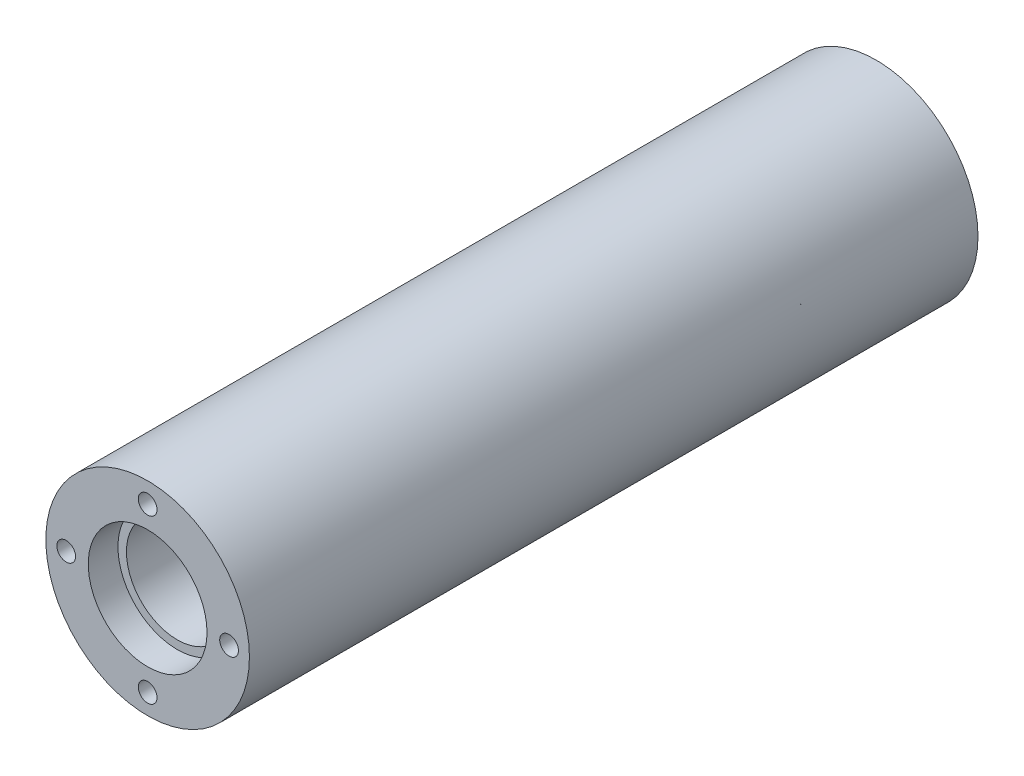
ISO-10303-21;
HEADER;
FILE_DESCRIPTION(('STEP AP214'),'2;1');
FILE_NAME('part.step','',(''),(''),'','','');
FILE_SCHEMA(('AUTOMOTIVE_DESIGN { 1 0 10303 214 1 1 1 1 }'));
ENDSEC;
DATA;
#1=APPLICATION_CONTEXT('core data for automotive mechanical design processes');
#2=APPLICATION_PROTOCOL_DEFINITION('international standard','automotive_design',2000,#1);
#3=PRODUCT_CONTEXT('',#1,'mechanical');
#4=PRODUCT('Part','Part','',(#3));
#5=PRODUCT_RELATED_PRODUCT_CATEGORY('part','',(#4));
#6=PRODUCT_DEFINITION_FORMATION('','',#4);
#7=PRODUCT_DEFINITION_CONTEXT('part definition',#1,'design');
#8=PRODUCT_DEFINITION('design','',#6,#7);
#9=PRODUCT_DEFINITION_SHAPE('','',#8);
#10=(LENGTH_UNIT() NAMED_UNIT(*) SI_UNIT(.MILLI.,.METRE.));
#11=(NAMED_UNIT(*) PLANE_ANGLE_UNIT() SI_UNIT($,.RADIAN.));
#12=(NAMED_UNIT(*) SI_UNIT($,.STERADIAN.) SOLID_ANGLE_UNIT());
#13=UNCERTAINTY_MEASURE_WITH_UNIT(LENGTH_MEASURE(1.E-05),#10,'distance_accuracy_value','');
#14=(GEOMETRIC_REPRESENTATION_CONTEXT(3) GLOBAL_UNCERTAINTY_ASSIGNED_CONTEXT((#13)) GLOBAL_UNIT_ASSIGNED_CONTEXT((#10,
#11,#12)) REPRESENTATION_CONTEXT('',''));
#15=CARTESIAN_POINT('',(0.,0.,0.));
#16=DIRECTION('',(0.,0.,1.));
#17=DIRECTION('',(1.,0.,0.));
#18=AXIS2_PLACEMENT_3D('',#15,#16,#17);
#19=CARTESIAN_POINT('',(0.,0.,136.3472));
#20=DIRECTION('',(0.,0.,-1.));
#21=DIRECTION('',(-1.,0.,0.));
#22=AXIS2_PLACEMENT_3D('',#19,#20,#21);
#23=CYLINDRICAL_SURFACE('',#22,9.525);
#24=CARTESIAN_POINT('',(0.,0.,130.79095));
#25=DIRECTION('',(0.,0.,1.));
#26=DIRECTION('',(1.,0.,0.));
#27=AXIS2_PLACEMENT_3D('',#24,#25,#26);
#28=CIRCLE('',#27,9.525);
#29=CARTESIAN_POINT('',(9.525,0.,130.79095));
#30=VERTEX_POINT('',#29);
#31=EDGE_CURVE('E55',#30,#30,#28,.T.);
#32=ORIENTED_EDGE('',*,*,#31,.T.);
#33=EDGE_LOOP('',(#32));
#34=FACE_BOUND('',#33,.T.);
#35=CARTESIAN_POINT('',(0.,0.,5.55625000000001));
#36=DIRECTION('',(0.,0.,-1.));
#37=DIRECTION('',(-1.,0.,0.));
#38=AXIS2_PLACEMENT_3D('',#35,#36,#37);
#39=CIRCLE('',#38,9.525);
#40=CARTESIAN_POINT('',(-9.525,0.,5.55625000000001));
#41=VERTEX_POINT('',#40);
#42=EDGE_CURVE('E41',#41,#41,#39,.T.);
#43=ORIENTED_EDGE('',*,*,#42,.T.);
#44=EDGE_LOOP('',(#43));
#45=FACE_BOUND('',#44,.T.);
#46=ADVANCED_FACE('F37',(#34,#45),#23,.F.);
#47=CARTESIAN_POINT('',(0.,0.,136.3472));
#48=DIRECTION('',(0.,0.,1.));
#49=DIRECTION('',(1.,0.,0.));
#50=AXIS2_PLACEMENT_3D('',#47,#48,#49);
#51=PLANE('',#50);
#52=CARTESIAN_POINT('',(0.,0.,136.3472));
#53=DIRECTION('',(0.,0.,1.));
#54=DIRECTION('',(1.,0.,0.));
#55=AXIS2_PLACEMENT_3D('',#52,#53,#54);
#56=CIRCLE('',#55,11.1125);
#57=CARTESIAN_POINT('',(11.1125,0.,136.3472));
#58=VERTEX_POINT('',#57);
#59=EDGE_CURVE('E65',#58,#58,#56,.T.);
#60=ORIENTED_EDGE('',*,*,#59,.F.);
#61=EDGE_LOOP('',(#60));
#62=FACE_BOUND('',#61,.T.);
#63=CARTESIAN_POINT('',(0.,15.24,136.3472));
#64=DIRECTION('',(0.,0.,1.));
#65=DIRECTION('',(1.,0.,0.));
#66=AXIS2_PLACEMENT_3D('',#63,#64,#65);
#67=CIRCLE('',#66,1.7526);
#68=CARTESIAN_POINT('',(1.7526,15.24,136.3472));
#69=VERTEX_POINT('',#68);
#70=EDGE_CURVE('E78',#69,#69,#67,.T.);
#71=ORIENTED_EDGE('',*,*,#70,.F.);
#72=EDGE_LOOP('',(#71));
#73=FACE_BOUND('',#72,.T.);
#74=CARTESIAN_POINT('',(15.2400000000005,5.01916330515765E-13,136.3472));
#75=DIRECTION('',(0.,0.,1.));
#76=DIRECTION('',(1.,0.,0.));
#77=AXIS2_PLACEMENT_3D('',#74,#75,#76);
#78=CIRCLE('',#77,1.7526);
#79=CARTESIAN_POINT('',(16.9926000000005,5.01916330515765E-13,136.3472));
#80=VERTEX_POINT('',#79);
#81=EDGE_CURVE('E81',#80,#80,#78,.T.);
#82=ORIENTED_EDGE('',*,*,#81,.F.);
#83=EDGE_LOOP('',(#82));
#84=FACE_BOUND('',#83,.T.);
#85=CARTESIAN_POINT('',(1.00383266103153E-12,-15.24,136.3472));
#86=DIRECTION('',(0.,0.,1.));
#87=DIRECTION('',(1.,0.,0.));
#88=AXIS2_PLACEMENT_3D('',#85,#86,#87);
#89=CIRCLE('',#88,1.7526);
#90=CARTESIAN_POINT('',(1.752600000001,-15.24,136.3472));
#91=VERTEX_POINT('',#90);
#92=EDGE_CURVE('E87',#91,#91,#89,.T.);
#93=ORIENTED_EDGE('',*,*,#92,.F.);
#94=EDGE_LOOP('',(#93));
#95=FACE_BOUND('',#94,.T.);
#96=CARTESIAN_POINT('',(-15.2399999999995,-5.03782692237666E-13,136.3472));
#97=DIRECTION('',(0.,0.,1.));
#98=DIRECTION('',(1.,0.,0.));
#99=AXIS2_PLACEMENT_3D('',#96,#97,#98);
#100=CIRCLE('',#99,1.7526);
#101=CARTESIAN_POINT('',(-13.4873999999995,-5.03782692237666E-13,136.3472));
#102=VERTEX_POINT('',#101);
#103=EDGE_CURVE('E62',#102,#102,#100,.T.);
#104=ORIENTED_EDGE('',*,*,#103,.F.);
#105=EDGE_LOOP('',(#104));
#106=FACE_BOUND('',#105,.T.);
#107=CARTESIAN_POINT('',(0.,0.,136.3472));
#108=DIRECTION('',(0.,0.,1.));
#109=DIRECTION('',(1.,0.,0.));
#110=AXIS2_PLACEMENT_3D('',#107,#108,#109);
#111=CIRCLE('',#110,19.05);
#112=CARTESIAN_POINT('',(19.05,0.,136.3472));
#113=VERTEX_POINT('',#112);
#114=EDGE_CURVE('E10',#113,#113,#111,.T.);
#115=ORIENTED_EDGE('',*,*,#114,.T.);
#116=EDGE_LOOP('',(#115));
#117=FACE_BOUND('',#116,.T.);
#118=ADVANCED_FACE('F133',(#62,#73,#84,#95,#106,#117),#51,.T.);
#119=CARTESIAN_POINT('',(0.,0.,0.));
#120=DIRECTION('',(0.,0.,1.));
#121=DIRECTION('',(1.,0.,0.));
#122=AXIS2_PLACEMENT_3D('',#119,#120,#121);
#123=PLANE('',#122);
#124=CARTESIAN_POINT('',(0.,0.,0.));
#125=DIRECTION('',(0.,0.,-1.));
#126=DIRECTION('',(-1.,0.,0.));
#127=AXIS2_PLACEMENT_3D('',#124,#125,#126);
#128=CIRCLE('',#127,11.1125);
#129=CARTESIAN_POINT('',(-11.1125,0.,0.));
#130=VERTEX_POINT('',#129);
#131=EDGE_CURVE('E72',#130,#130,#128,.T.);
#132=ORIENTED_EDGE('',*,*,#131,.F.);
#133=EDGE_LOOP('',(#132));
#134=FACE_BOUND('',#133,.T.);
#135=CARTESIAN_POINT('',(0.,15.24,0.));
#136=DIRECTION('',(0.,0.,-1.));
#137=DIRECTION('',(-1.,0.,0.));
#138=AXIS2_PLACEMENT_3D('',#135,#136,#137);
#139=CIRCLE('',#138,1.7526);
#140=CARTESIAN_POINT('',(-1.7526,15.24,0.));
#141=VERTEX_POINT('',#140);
#142=EDGE_CURVE('E97',#141,#141,#139,.T.);
#143=ORIENTED_EDGE('',*,*,#142,.F.);
#144=EDGE_LOOP('',(#143));
#145=FACE_BOUND('',#144,.T.);
#146=CARTESIAN_POINT('',(-15.2400000000005,5.01916330515765E-13,0.));
#147=DIRECTION('',(0.,0.,-1.));
#148=DIRECTION('',(-1.,0.,0.));
#149=AXIS2_PLACEMENT_3D('',#146,#147,#148);
#150=CIRCLE('',#149,1.7526);
#151=CARTESIAN_POINT('',(-16.9926000000005,5.01916330515765E-13,0.));
#152=VERTEX_POINT('',#151);
#153=EDGE_CURVE('E100',#152,#152,#150,.T.);
#154=ORIENTED_EDGE('',*,*,#153,.F.);
#155=EDGE_LOOP('',(#154));
#156=FACE_BOUND('',#155,.T.);
#157=CARTESIAN_POINT('',(-1.00383266103153E-12,-15.24,0.));
#158=DIRECTION('',(0.,0.,-1.));
#159=DIRECTION('',(-1.,0.,0.));
#160=AXIS2_PLACEMENT_3D('',#157,#158,#159);
#161=CIRCLE('',#160,1.7526);
#162=CARTESIAN_POINT('',(-1.752600000001,-15.24,0.));
#163=VERTEX_POINT('',#162);
#164=EDGE_CURVE('E106',#163,#163,#161,.T.);
#165=ORIENTED_EDGE('',*,*,#164,.F.);
#166=EDGE_LOOP('',(#165));
#167=FACE_BOUND('',#166,.T.);
#168=CARTESIAN_POINT('',(15.2399999999995,-5.03782692237666E-13,0.));
#169=DIRECTION('',(0.,0.,-1.));
#170=DIRECTION('',(-1.,0.,0.));
#171=AXIS2_PLACEMENT_3D('',#168,#169,#170);
#172=CIRCLE('',#171,1.7526);
#173=CARTESIAN_POINT('',(13.4873999999995,-5.03782692237666E-13,0.));
#174=VERTEX_POINT('',#173);
#175=EDGE_CURVE('E111',#174,#174,#172,.T.);
#176=ORIENTED_EDGE('',*,*,#175,.F.);
#177=EDGE_LOOP('',(#176));
#178=FACE_BOUND('',#177,.T.);
#179=CARTESIAN_POINT('',(0.,0.,0.));
#180=DIRECTION('',(0.,0.,1.));
#181=DIRECTION('',(1.,0.,0.));
#182=AXIS2_PLACEMENT_3D('',#179,#180,#181);
#183=CIRCLE('',#182,19.05);
#184=CARTESIAN_POINT('',(19.05,0.,0.));
#185=VERTEX_POINT('',#184);
#186=EDGE_CURVE('E45',#185,#185,#183,.T.);
#187=ORIENTED_EDGE('',*,*,#186,.F.);
#188=EDGE_LOOP('',(#187));
#189=FACE_BOUND('',#188,.T.);
#190=ADVANCED_FACE('F129',(#134,#145,#156,#167,#178,#189),#123,.F.);
#191=CARTESIAN_POINT('',(0.,0.,136.3472));
#192=DIRECTION('',(0.,0.,-1.));
#193=DIRECTION('',(-1.,0.,0.));
#194=AXIS2_PLACEMENT_3D('',#191,#192,#193);
#195=CYLINDRICAL_SURFACE('',#194,19.05);
#196=ORIENTED_EDGE('',*,*,#114,.F.);
#197=EDGE_LOOP('',(#196));
#198=FACE_BOUND('',#197,.T.);
#199=ORIENTED_EDGE('',*,*,#186,.T.);
#200=EDGE_LOOP('',(#199));
#201=FACE_BOUND('',#200,.T.);
#202=ADVANCED_FACE('F39',(#198,#201),#195,.T.);
#203=CARTESIAN_POINT('',(15.2399999999995,-5.03782692237666E-13,9.525));
#204=DIRECTION('',(0.,0.,-1.));
#205=DIRECTION('',(-1.,0.,0.));
#206=AXIS2_PLACEMENT_3D('',#203,#204,#205);
#207=CYLINDRICAL_SURFACE('',#206,1.7526);
#208=CARTESIAN_POINT('',(15.2399999999995,-5.03782692237666E-13,9.525));
#209=DIRECTION('',(0.,0.,-1.));
#210=DIRECTION('',(-1.,0.,0.));
#211=AXIS2_PLACEMENT_3D('',#208,#209,#210);
#212=CIRCLE('',#211,1.7526);
#213=CARTESIAN_POINT('',(13.4873999999995,-5.03782692237666E-13,9.525));
#214=VERTEX_POINT('',#213);
#215=EDGE_CURVE('E53',#214,#214,#212,.T.);
#216=ORIENTED_EDGE('',*,*,#215,.F.);
#217=EDGE_LOOP('',(#216));
#218=FACE_BOUND('',#217,.T.);
#219=ORIENTED_EDGE('',*,*,#175,.T.);
#220=EDGE_LOOP('',(#219));
#221=FACE_BOUND('',#220,.T.);
#222=ADVANCED_FACE('F120',(#218,#221),#207,.F.);
#223=CARTESIAN_POINT('',(15.2399999999995,-5.03782692237666E-13,9.525));
#224=DIRECTION('',(0.,0.,-1.));
#225=DIRECTION('',(-1.,0.,0.));
#226=AXIS2_PLACEMENT_3D('',#223,#224,#225);
#227=PLANE('',#226);
#228=ORIENTED_EDGE('',*,*,#215,.T.);
#229=EDGE_LOOP('',(#228));
#230=FACE_BOUND('',#229,.T.);
#231=ADVANCED_FACE('F118',(#230),#227,.T.);
#232=CARTESIAN_POINT('',(-1.00383266103153E-12,-15.24,9.525));
#233=DIRECTION('',(0.,0.,-1.));
#234=DIRECTION('',(-1.,0.,0.));
#235=AXIS2_PLACEMENT_3D('',#232,#233,#234);
#236=CYLINDRICAL_SURFACE('',#235,1.7526);
#237=CARTESIAN_POINT('',(-1.00383266103153E-12,-15.24,9.525));
#238=DIRECTION('',(0.,0.,-1.));
#239=DIRECTION('',(-1.,0.,0.));
#240=AXIS2_PLACEMENT_3D('',#237,#238,#239);
#241=CIRCLE('',#240,1.7526);
#242=CARTESIAN_POINT('',(-1.752600000001,-15.24,9.525));
#243=VERTEX_POINT('',#242);
#244=EDGE_CURVE('E109',#243,#243,#241,.T.);
#245=ORIENTED_EDGE('',*,*,#244,.F.);
#246=EDGE_LOOP('',(#245));
#247=FACE_BOUND('',#246,.T.);
#248=ORIENTED_EDGE('',*,*,#164,.T.);
#249=EDGE_LOOP('',(#248));
#250=FACE_BOUND('',#249,.T.);
#251=ADVANCED_FACE('F127',(#247,#250),#236,.F.);
#252=CARTESIAN_POINT('',(-1.00383266103153E-12,-15.24,9.525));
#253=DIRECTION('',(0.,0.,-1.));
#254=DIRECTION('',(-1.,0.,0.));
#255=AXIS2_PLACEMENT_3D('',#252,#253,#254);
#256=PLANE('',#255);
#257=ORIENTED_EDGE('',*,*,#244,.T.);
#258=EDGE_LOOP('',(#257));
#259=FACE_BOUND('',#258,.T.);
#260=ADVANCED_FACE('F159',(#259),#256,.T.);
#261=CARTESIAN_POINT('',(-15.2400000000005,5.01916330515765E-13,9.525));
#262=DIRECTION('',(0.,0.,-1.));
#263=DIRECTION('',(-1.,0.,0.));
#264=AXIS2_PLACEMENT_3D('',#261,#262,#263);
#265=CYLINDRICAL_SURFACE('',#264,1.7526);
#266=CARTESIAN_POINT('',(-15.2400000000005,5.01916330515765E-13,9.525));
#267=DIRECTION('',(0.,0.,-1.));
#268=DIRECTION('',(-1.,0.,0.));
#269=AXIS2_PLACEMENT_3D('',#266,#267,#268);
#270=CIRCLE('',#269,1.7526);
#271=CARTESIAN_POINT('',(-16.9926000000005,5.01916330515765E-13,9.525));
#272=VERTEX_POINT('',#271);
#273=EDGE_CURVE('E103',#272,#272,#270,.T.);
#274=ORIENTED_EDGE('',*,*,#273,.F.);
#275=EDGE_LOOP('',(#274));
#276=FACE_BOUND('',#275,.T.);
#277=ORIENTED_EDGE('',*,*,#153,.T.);
#278=EDGE_LOOP('',(#277));
#279=FACE_BOUND('',#278,.T.);
#280=ADVANCED_FACE('F165',(#276,#279),#265,.F.);
#281=CARTESIAN_POINT('',(-15.2400000000005,5.01916330515765E-13,9.525));
#282=DIRECTION('',(0.,0.,-1.));
#283=DIRECTION('',(-1.,0.,0.));
#284=AXIS2_PLACEMENT_3D('',#281,#282,#283);
#285=PLANE('',#284);
#286=ORIENTED_EDGE('',*,*,#273,.T.);
#287=EDGE_LOOP('',(#286));
#288=FACE_BOUND('',#287,.T.);
#289=ADVANCED_FACE('F169',(#288),#285,.T.);
#290=CARTESIAN_POINT('',(0.,15.24,9.525));
#291=DIRECTION('',(0.,0.,-1.));
#292=DIRECTION('',(-1.,0.,0.));
#293=AXIS2_PLACEMENT_3D('',#290,#291,#292);
#294=CYLINDRICAL_SURFACE('',#293,1.7526);
#295=CARTESIAN_POINT('',(0.,15.24,9.525));
#296=DIRECTION('',(0.,0.,-1.));
#297=DIRECTION('',(-1.,0.,0.));
#298=AXIS2_PLACEMENT_3D('',#295,#296,#297);
#299=CIRCLE('',#298,1.7526);
#300=CARTESIAN_POINT('',(-1.7526,15.24,9.525));
#301=VERTEX_POINT('',#300);
#302=EDGE_CURVE('E50',#301,#301,#299,.T.);
#303=ORIENTED_EDGE('',*,*,#302,.F.);
#304=EDGE_LOOP('',(#303));
#305=FACE_BOUND('',#304,.T.);
#306=ORIENTED_EDGE('',*,*,#142,.T.);
#307=EDGE_LOOP('',(#306));
#308=FACE_BOUND('',#307,.T.);
#309=ADVANCED_FACE('F172',(#305,#308),#294,.F.);
#310=CARTESIAN_POINT('',(0.,15.24,9.525));
#311=DIRECTION('',(0.,0.,-1.));
#312=DIRECTION('',(-1.,0.,0.));
#313=AXIS2_PLACEMENT_3D('',#310,#311,#312);
#314=PLANE('',#313);
#315=ORIENTED_EDGE('',*,*,#302,.T.);
#316=EDGE_LOOP('',(#315));
#317=FACE_BOUND('',#316,.T.);
#318=ADVANCED_FACE('F179',(#317),#314,.T.);
#319=CARTESIAN_POINT('',(-15.2399999999995,-5.03782692237666E-13,126.8222));
#320=DIRECTION('',(0.,0.,1.));
#321=DIRECTION('',(1.,0.,0.));
#322=AXIS2_PLACEMENT_3D('',#319,#320,#321);
#323=CYLINDRICAL_SURFACE('',#322,1.7526);
#324=CARTESIAN_POINT('',(-15.2399999999995,-5.03782692237666E-13,126.8222));
#325=DIRECTION('',(0.,0.,1.));
#326=DIRECTION('',(1.,0.,0.));
#327=AXIS2_PLACEMENT_3D('',#324,#325,#326);
#328=CIRCLE('',#327,1.7526);
#329=CARTESIAN_POINT('',(-13.4873999999995,-5.03782692237666E-13,126.8222));
#330=VERTEX_POINT('',#329);
#331=EDGE_CURVE('E57',#330,#330,#328,.T.);
#332=ORIENTED_EDGE('',*,*,#331,.F.);
#333=EDGE_LOOP('',(#332));
#334=FACE_BOUND('',#333,.T.);
#335=ORIENTED_EDGE('',*,*,#103,.T.);
#336=EDGE_LOOP('',(#335));
#337=FACE_BOUND('',#336,.T.);
#338=ADVANCED_FACE('F183',(#334,#337),#323,.F.);
#339=CARTESIAN_POINT('',(-15.2399999999995,-5.03782692237666E-13,126.8222));
#340=DIRECTION('',(0.,0.,1.));
#341=DIRECTION('',(1.,0.,0.));
#342=AXIS2_PLACEMENT_3D('',#339,#340,#341);
#343=PLANE('',#342);
#344=ORIENTED_EDGE('',*,*,#331,.T.);
#345=EDGE_LOOP('',(#344));
#346=FACE_BOUND('',#345,.T.);
#347=ADVANCED_FACE('F185',(#346),#343,.T.);
#348=CARTESIAN_POINT('',(1.00383266103153E-12,-15.24,126.8222));
#349=DIRECTION('',(0.,0.,1.));
#350=DIRECTION('',(1.,0.,0.));
#351=AXIS2_PLACEMENT_3D('',#348,#349,#350);
#352=CYLINDRICAL_SURFACE('',#351,1.7526);
#353=CARTESIAN_POINT('',(1.00383266103153E-12,-15.24,126.8222));
#354=DIRECTION('',(0.,0.,1.));
#355=DIRECTION('',(1.,0.,0.));
#356=AXIS2_PLACEMENT_3D('',#353,#354,#355);
#357=CIRCLE('',#356,1.7526);
#358=CARTESIAN_POINT('',(1.752600000001,-15.24,126.8222));
#359=VERTEX_POINT('',#358);
#360=EDGE_CURVE('E90',#359,#359,#357,.T.);
#361=ORIENTED_EDGE('',*,*,#360,.F.);
#362=EDGE_LOOP('',(#361));
#363=FACE_BOUND('',#362,.T.);
#364=ORIENTED_EDGE('',*,*,#92,.T.);
#365=EDGE_LOOP('',(#364));
#366=FACE_BOUND('',#365,.T.);
#367=ADVANCED_FACE('F188',(#363,#366),#352,.F.);
#368=CARTESIAN_POINT('',(1.00383266103153E-12,-15.24,126.8222));
#369=DIRECTION('',(0.,0.,1.));
#370=DIRECTION('',(1.,0.,0.));
#371=AXIS2_PLACEMENT_3D('',#368,#369,#370);
#372=PLANE('',#371);
#373=ORIENTED_EDGE('',*,*,#360,.T.);
#374=EDGE_LOOP('',(#373));
#375=FACE_BOUND('',#374,.T.);
#376=ADVANCED_FACE('F193',(#375),#372,.T.);
#377=CARTESIAN_POINT('',(15.2400000000005,5.01916330515765E-13,126.8222));
#378=DIRECTION('',(0.,0.,1.));
#379=DIRECTION('',(1.,0.,0.));
#380=AXIS2_PLACEMENT_3D('',#377,#378,#379);
#381=CYLINDRICAL_SURFACE('',#380,1.7526);
#382=CARTESIAN_POINT('',(15.2400000000005,5.01916330515765E-13,126.8222));
#383=DIRECTION('',(0.,0.,1.));
#384=DIRECTION('',(1.,0.,0.));
#385=AXIS2_PLACEMENT_3D('',#382,#383,#384);
#386=CIRCLE('',#385,1.7526);
#387=CARTESIAN_POINT('',(16.9926000000005,5.01916330515765E-13,126.8222));
#388=VERTEX_POINT('',#387);
#389=EDGE_CURVE('E84',#388,#388,#386,.T.);
#390=ORIENTED_EDGE('',*,*,#389,.F.);
#391=EDGE_LOOP('',(#390));
#392=FACE_BOUND('',#391,.T.);
#393=ORIENTED_EDGE('',*,*,#81,.T.);
#394=EDGE_LOOP('',(#393));
#395=FACE_BOUND('',#394,.T.);
#396=ADVANCED_FACE('F196',(#392,#395),#381,.F.);
#397=CARTESIAN_POINT('',(15.2400000000005,5.01916330515765E-13,126.8222));
#398=DIRECTION('',(0.,0.,1.));
#399=DIRECTION('',(1.,0.,0.));
#400=AXIS2_PLACEMENT_3D('',#397,#398,#399);
#401=PLANE('',#400);
#402=ORIENTED_EDGE('',*,*,#389,.T.);
#403=EDGE_LOOP('',(#402));
#404=FACE_BOUND('',#403,.T.);
#405=ADVANCED_FACE('F201',(#404),#401,.T.);
#406=CARTESIAN_POINT('',(0.,15.24,126.8222));
#407=DIRECTION('',(0.,0.,1.));
#408=DIRECTION('',(1.,0.,0.));
#409=AXIS2_PLACEMENT_3D('',#406,#407,#408);
#410=CYLINDRICAL_SURFACE('',#409,1.7526);
#411=CARTESIAN_POINT('',(0.,15.24,126.8222));
#412=DIRECTION('',(0.,0.,1.));
#413=DIRECTION('',(1.,0.,0.));
#414=AXIS2_PLACEMENT_3D('',#411,#412,#413);
#415=CIRCLE('',#414,1.7526);
#416=CARTESIAN_POINT('',(1.7526,15.24,126.8222));
#417=VERTEX_POINT('',#416);
#418=EDGE_CURVE('E75',#417,#417,#415,.T.);
#419=ORIENTED_EDGE('',*,*,#418,.F.);
#420=EDGE_LOOP('',(#419));
#421=FACE_BOUND('',#420,.T.);
#422=ORIENTED_EDGE('',*,*,#70,.T.);
#423=EDGE_LOOP('',(#422));
#424=FACE_BOUND('',#423,.T.);
#425=ADVANCED_FACE('F204',(#421,#424),#410,.F.);
#426=CARTESIAN_POINT('',(0.,15.24,126.8222));
#427=DIRECTION('',(0.,0.,1.));
#428=DIRECTION('',(1.,0.,0.));
#429=AXIS2_PLACEMENT_3D('',#426,#427,#428);
#430=PLANE('',#429);
#431=ORIENTED_EDGE('',*,*,#418,.T.);
#432=EDGE_LOOP('',(#431));
#433=FACE_BOUND('',#432,.T.);
#434=ADVANCED_FACE('F211',(#433),#430,.T.);
#435=CARTESIAN_POINT('',(0.,0.,130.79095));
#436=DIRECTION('',(0.,0.,1.));
#437=DIRECTION('',(1.,0.,0.));
#438=AXIS2_PLACEMENT_3D('',#435,#436,#437);
#439=CYLINDRICAL_SURFACE('',#438,11.1125);
#440=CARTESIAN_POINT('',(0.,0.,130.79095));
#441=DIRECTION('',(0.,0.,1.));
#442=DIRECTION('',(1.,0.,0.));
#443=AXIS2_PLACEMENT_3D('',#440,#441,#442);
#444=CIRCLE('',#443,11.1125);
#445=CARTESIAN_POINT('',(11.1125,0.,130.79095));
#446=VERTEX_POINT('',#445);
#447=EDGE_CURVE('E58',#446,#446,#444,.T.);
#448=ORIENTED_EDGE('',*,*,#447,.F.);
#449=EDGE_LOOP('',(#448));
#450=FACE_BOUND('',#449,.T.);
#451=ORIENTED_EDGE('',*,*,#59,.T.);
#452=EDGE_LOOP('',(#451));
#453=FACE_BOUND('',#452,.T.);
#454=ADVANCED_FACE('F215',(#450,#453),#439,.F.);
#455=CARTESIAN_POINT('',(0.,0.,130.79095));
#456=DIRECTION('',(0.,0.,1.));
#457=DIRECTION('',(1.,0.,0.));
#458=AXIS2_PLACEMENT_3D('',#455,#456,#457);
#459=PLANE('',#458);
#460=ORIENTED_EDGE('',*,*,#31,.F.);
#461=EDGE_LOOP('',(#460));
#462=FACE_BOUND('',#461,.T.);
#463=ORIENTED_EDGE('',*,*,#447,.T.);
#464=EDGE_LOOP('',(#463));
#465=FACE_BOUND('',#464,.T.);
#466=ADVANCED_FACE('F219',(#462,#465),#459,.T.);
#467=CARTESIAN_POINT('',(0.,0.,5.55625));
#468=DIRECTION('',(0.,0.,-1.));
#469=DIRECTION('',(-1.,0.,0.));
#470=AXIS2_PLACEMENT_3D('',#467,#468,#469);
#471=CYLINDRICAL_SURFACE('',#470,11.1125);
#472=CARTESIAN_POINT('',(0.,0.,5.55625));
#473=DIRECTION('',(0.,0.,-1.));
#474=DIRECTION('',(-1.,0.,0.));
#475=AXIS2_PLACEMENT_3D('',#472,#473,#474);
#476=CIRCLE('',#475,11.1125);
#477=CARTESIAN_POINT('',(-11.1125,0.,5.55625));
#478=VERTEX_POINT('',#477);
#479=EDGE_CURVE('E238',#478,#478,#476,.T.);
#480=ORIENTED_EDGE('',*,*,#479,.F.);
#481=EDGE_LOOP('',(#480));
#482=FACE_BOUND('',#481,.T.);
#483=ORIENTED_EDGE('',*,*,#131,.T.);
#484=EDGE_LOOP('',(#483));
#485=FACE_BOUND('',#484,.T.);
#486=ADVANCED_FACE('F223',(#482,#485),#471,.F.);
#487=CARTESIAN_POINT('',(0.,0.,5.55625));
#488=DIRECTION('',(0.,0.,-1.));
#489=DIRECTION('',(-1.,0.,0.));
#490=AXIS2_PLACEMENT_3D('',#487,#488,#489);
#491=PLANE('',#490);
#492=ORIENTED_EDGE('',*,*,#42,.F.);
#493=EDGE_LOOP('',(#492));
#494=FACE_BOUND('',#493,.T.);
#495=ORIENTED_EDGE('',*,*,#479,.T.);
#496=EDGE_LOOP('',(#495));
#497=FACE_BOUND('',#496,.T.);
#498=ADVANCED_FACE('F227',(#494,#497),#491,.T.);
#499=CLOSED_SHELL('',(#46,#118,#190,#202,#222,#231,#251,#260,#280,#289,#309,#318,#338,#347,#367,
#376,#396,#405,#425,#434,#454,#466,#486,#498));
#500=MANIFOLD_SOLID_BREP('B2',#499);
#501=ADVANCED_BREP_SHAPE_REPRESENTATION('',(#18,#500),#14);
#502=SHAPE_DEFINITION_REPRESENTATION(#9,#501);
ENDSEC;
END-ISO-10303-21;
